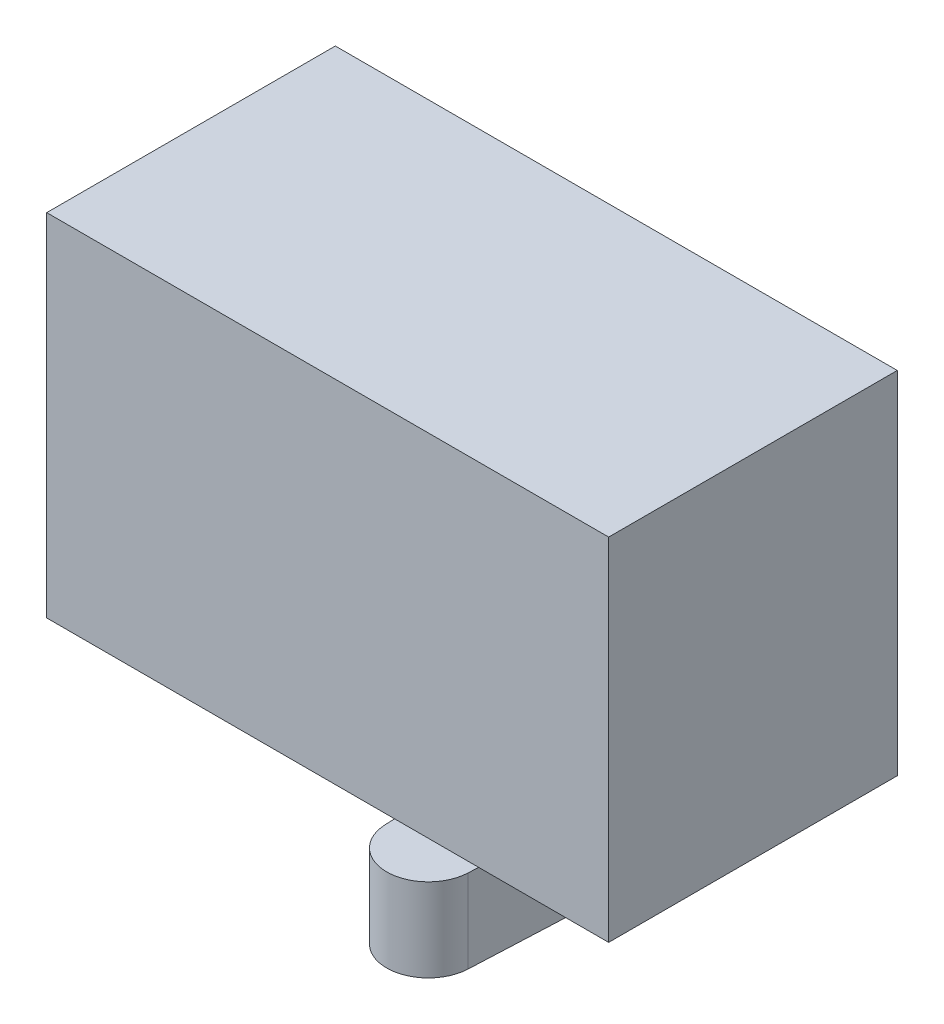
ISO-10303-21;
HEADER;
FILE_DESCRIPTION(('STEP AP214'),'2;1');
FILE_NAME('part.step','',(''),(''),'','','');
FILE_SCHEMA(('AUTOMOTIVE_DESIGN { 1 0 10303 214 1 1 1 1 }'));
ENDSEC;
DATA;
#1=APPLICATION_CONTEXT('core data for automotive mechanical design processes');
#2=APPLICATION_PROTOCOL_DEFINITION('international standard','automotive_design',2000,#1);
#3=PRODUCT_CONTEXT('',#1,'mechanical');
#4=PRODUCT('Part','Part','',(#3));
#5=PRODUCT_RELATED_PRODUCT_CATEGORY('part','',(#4));
#6=PRODUCT_DEFINITION_FORMATION('','',#4);
#7=PRODUCT_DEFINITION_CONTEXT('part definition',#1,'design');
#8=PRODUCT_DEFINITION('design','',#6,#7);
#9=PRODUCT_DEFINITION_SHAPE('','',#8);
#10=(LENGTH_UNIT() NAMED_UNIT(*) SI_UNIT(.MILLI.,.METRE.));
#11=(NAMED_UNIT(*) PLANE_ANGLE_UNIT() SI_UNIT($,.RADIAN.));
#12=(NAMED_UNIT(*) SI_UNIT($,.STERADIAN.) SOLID_ANGLE_UNIT());
#13=UNCERTAINTY_MEASURE_WITH_UNIT(LENGTH_MEASURE(1.E-05),#10,'distance_accuracy_value','');
#14=(GEOMETRIC_REPRESENTATION_CONTEXT(3) GLOBAL_UNCERTAINTY_ASSIGNED_CONTEXT((#13)) GLOBAL_UNIT_ASSIGNED_CONTEXT((#10,
#11,#12)) REPRESENTATION_CONTEXT('',''));
#15=CARTESIAN_POINT('',(0.,0.,0.));
#16=DIRECTION('',(0.,0.,1.));
#17=DIRECTION('',(1.,0.,0.));
#18=AXIS2_PLACEMENT_3D('',#15,#16,#17);
#19=CARTESIAN_POINT('',(7.85,-18.65,11.));
#20=DIRECTION('',(0.,1.,0.));
#21=DIRECTION('',(0.,0.,1.));
#22=AXIS2_PLACEMENT_3D('',#19,#20,#21);
#23=CYLINDRICAL_SURFACE('',#22,3.);
#24=CARTESIAN_POINT('',(7.85,-12.65,11.));
#25=DIRECTION('',(0.,-1.,0.));
#26=DIRECTION('',(0.,0.,-1.));
#27=AXIS2_PLACEMENT_3D('',#24,#25,#26);
#28=CIRCLE('',#27,3.);
#29=CARTESIAN_POINT('',(10.8468992239776,-12.65,11.1363636363636));
#30=VERTEX_POINT('',#29);
#31=CARTESIAN_POINT('',(4.85310077602238,-12.65,11.1363636363636));
#32=VERTEX_POINT('',#31);
#33=EDGE_CURVE('E141',#30,#32,#28,.T.);
#34=ORIENTED_EDGE('',*,*,#33,.T.);
#35=DIRECTION('',(0.,1.,0.));
#36=VECTOR('',#35,1.);
#37=CARTESIAN_POINT('',(4.85310077602238,-18.65,11.1363636363636));
#38=LINE('',#37,#36);
#39=CARTESIAN_POINT('',(4.85310077602238,-18.65,11.1363636363636));
#40=VERTEX_POINT('',#39);
#41=EDGE_CURVE('E12',#40,#32,#38,.T.);
#42=ORIENTED_EDGE('',*,*,#41,.F.);
#43=CARTESIAN_POINT('',(7.85,-18.65,11.));
#44=DIRECTION('',(0.,-1.,0.));
#45=DIRECTION('',(0.,0.,-1.));
#46=AXIS2_PLACEMENT_3D('',#43,#44,#45);
#47=CIRCLE('',#46,3.);
#48=CARTESIAN_POINT('',(10.8468992239776,-18.65,11.1363636363636));
#49=VERTEX_POINT('',#48);
#50=EDGE_CURVE('E155',#49,#40,#47,.T.);
#51=ORIENTED_EDGE('',*,*,#50,.F.);
#52=DIRECTION('',(0.,1.,0.));
#53=VECTOR('',#52,1.);
#54=CARTESIAN_POINT('',(10.8468992239776,-18.65,11.1363636363636));
#55=LINE('',#54,#53);
#56=EDGE_CURVE('E137',#49,#30,#55,.T.);
#57=ORIENTED_EDGE('',*,*,#56,.T.);
#58=EDGE_LOOP('',(#34,#42,#51,#57));
#59=FACE_BOUND('',#58,.T.);
#60=ADVANCED_FACE('F45',(#59),#23,.T.);
#61=CARTESIAN_POINT('',(4.85310077602238,-18.65,11.1363636363636));
#62=DIRECTION('',(0.998966407992541,0.,-0.0454545454545457));
#63=DIRECTION('',(-0.0454545454545457,0.,-0.998966407992542));
#64=AXIS2_PLACEMENT_3D('',#61,#62,#63);
#65=PLANE('',#64);
#66=DIRECTION('',(-0.0454545454545457,0.,-0.998966407992541));
#67=VECTOR('',#66,1.);
#68=CARTESIAN_POINT('',(4.85310077602238,-12.65,11.1363636363636));
#69=LINE('',#68,#67);
#70=CARTESIAN_POINT('',(4.3536175720261,-12.65,0.159090909090907));
#71=VERTEX_POINT('',#70);
#72=EDGE_CURVE('E144',#32,#71,#69,.T.);
#73=ORIENTED_EDGE('',*,*,#72,.T.);
#74=DIRECTION('',(0.,1.,0.));
#75=VECTOR('',#74,1.);
#76=CARTESIAN_POINT('',(4.3536175720261,-18.65,0.159090909090907));
#77=LINE('',#76,#75);
#78=CARTESIAN_POINT('',(4.3536175720261,-18.65,0.159090909090907));
#79=VERTEX_POINT('',#78);
#80=EDGE_CURVE('E53',#79,#71,#77,.T.);
#81=ORIENTED_EDGE('',*,*,#80,.F.);
#82=DIRECTION('',(-0.0454545454545457,0.,-0.998966407992541));
#83=VECTOR('',#82,1.);
#84=CARTESIAN_POINT('',(4.85310077602238,-18.65,11.1363636363636));
#85=LINE('',#84,#83);
#86=EDGE_CURVE('E104',#40,#79,#85,.T.);
#87=ORIENTED_EDGE('',*,*,#86,.F.);
#88=ORIENTED_EDGE('',*,*,#41,.T.);
#89=EDGE_LOOP('',(#73,#81,#87,#88));
#90=FACE_BOUND('',#89,.T.);
#91=ADVANCED_FACE('F190',(#90),#65,.F.);
#92=CARTESIAN_POINT('',(7.85,-18.65,0.));
#93=DIRECTION('',(0.,1.,0.));
#94=DIRECTION('',(0.,0.,1.));
#95=AXIS2_PLACEMENT_3D('',#92,#93,#94);
#96=CYLINDRICAL_SURFACE('',#95,3.5);
#97=CARTESIAN_POINT('',(7.85,-12.65,0.));
#98=DIRECTION('',(0.,-1.,0.));
#99=DIRECTION('',(0.,0.,-1.));
#100=AXIS2_PLACEMENT_3D('',#97,#98,#99);
#101=CIRCLE('',#100,3.5);
#102=CARTESIAN_POINT('',(4.3536175720261,-12.65,-0.159090909090905));
#103=VERTEX_POINT('',#102);
#104=EDGE_CURVE('E146',#71,#103,#101,.T.);
#105=ORIENTED_EDGE('',*,*,#104,.T.);
#106=DIRECTION('',(0.,1.,0.));
#107=VECTOR('',#106,1.);
#108=CARTESIAN_POINT('',(4.3536175720261,-18.65,-0.159090909090905));
#109=LINE('',#108,#107);
#110=CARTESIAN_POINT('',(4.3536175720261,-18.65,-0.159090909090905));
#111=VERTEX_POINT('',#110);
#112=EDGE_CURVE('E162',#111,#103,#109,.T.);
#113=ORIENTED_EDGE('',*,*,#112,.F.);
#114=CARTESIAN_POINT('',(7.85,-18.65,0.));
#115=DIRECTION('',(0.,-1.,0.));
#116=DIRECTION('',(0.,0.,-1.));
#117=AXIS2_PLACEMENT_3D('',#114,#115,#116);
#118=CIRCLE('',#117,3.5);
#119=EDGE_CURVE('E170',#79,#111,#118,.T.);
#120=ORIENTED_EDGE('',*,*,#119,.F.);
#121=ORIENTED_EDGE('',*,*,#80,.T.);
#122=EDGE_LOOP('',(#105,#113,#120,#121));
#123=FACE_BOUND('',#122,.T.);
#124=ADVANCED_FACE('F168',(#123),#96,.T.);
#125=CARTESIAN_POINT('',(4.3536175720261,-18.65,-0.159090909090907));
#126=DIRECTION('',(0.998966407992541,0.,0.0454545454545457));
#127=DIRECTION('',(0.0454545454545457,0.,-0.998966407992542));
#128=AXIS2_PLACEMENT_3D('',#125,#126,#127);
#129=PLANE('',#128);
#130=DIRECTION('',(0.0454545454545457,0.,-0.998966407992541));
#131=VECTOR('',#130,1.);
#132=CARTESIAN_POINT('',(4.3536175720261,-12.65,-0.159090909090907));
#133=LINE('',#132,#131);
#134=CARTESIAN_POINT('',(4.85310077602238,-12.65,-11.1363636363636));
#135=VERTEX_POINT('',#134);
#136=EDGE_CURVE('E148',#103,#135,#133,.T.);
#137=ORIENTED_EDGE('',*,*,#136,.T.);
#138=DIRECTION('',(0.,1.,0.));
#139=VECTOR('',#138,1.);
#140=CARTESIAN_POINT('',(4.85310077602238,-18.65,-11.1363636363636));
#141=LINE('',#140,#139);
#142=CARTESIAN_POINT('',(4.85310077602238,-18.65,-11.1363636363636));
#143=VERTEX_POINT('',#142);
#144=EDGE_CURVE('E159',#143,#135,#141,.T.);
#145=ORIENTED_EDGE('',*,*,#144,.F.);
#146=DIRECTION('',(0.0454545454545457,0.,-0.998966407992541));
#147=VECTOR('',#146,1.);
#148=CARTESIAN_POINT('',(4.3536175720261,-18.65,-0.159090909090907));
#149=LINE('',#148,#147);
#150=EDGE_CURVE('E182',#111,#143,#149,.T.);
#151=ORIENTED_EDGE('',*,*,#150,.F.);
#152=ORIENTED_EDGE('',*,*,#112,.T.);
#153=EDGE_LOOP('',(#137,#145,#151,#152));
#154=FACE_BOUND('',#153,.T.);
#155=ADVANCED_FACE('F178',(#154),#129,.F.);
#156=CARTESIAN_POINT('',(7.85,-18.65,-11.));
#157=DIRECTION('',(0.,1.,0.));
#158=DIRECTION('',(0.,0.,1.));
#159=AXIS2_PLACEMENT_3D('',#156,#157,#158);
#160=CYLINDRICAL_SURFACE('',#159,3.);
#161=CARTESIAN_POINT('',(7.85,-12.65,-11.));
#162=DIRECTION('',(0.,-1.,0.));
#163=DIRECTION('',(0.,0.,-1.));
#164=AXIS2_PLACEMENT_3D('',#161,#162,#163);
#165=CIRCLE('',#164,3.);
#166=CARTESIAN_POINT('',(10.8468992239776,-12.65,-11.1363636363636));
#167=VERTEX_POINT('',#166);
#168=EDGE_CURVE('E150',#135,#167,#165,.T.);
#169=ORIENTED_EDGE('',*,*,#168,.T.);
#170=DIRECTION('',(0.,1.,0.));
#171=VECTOR('',#170,1.);
#172=CARTESIAN_POINT('',(10.8468992239776,-18.65,-11.1363636363636));
#173=LINE('',#172,#171);
#174=CARTESIAN_POINT('',(10.8468992239776,-18.65,-11.1363636363636));
#175=VERTEX_POINT('',#174);
#176=EDGE_CURVE('E132',#175,#167,#173,.T.);
#177=ORIENTED_EDGE('',*,*,#176,.F.);
#178=CARTESIAN_POINT('',(7.85,-18.65,-11.));
#179=DIRECTION('',(0.,-1.,0.));
#180=DIRECTION('',(0.,0.,-1.));
#181=AXIS2_PLACEMENT_3D('',#178,#179,#180);
#182=CIRCLE('',#181,3.);
#183=EDGE_CURVE('E123',#143,#175,#182,.T.);
#184=ORIENTED_EDGE('',*,*,#183,.F.);
#185=ORIENTED_EDGE('',*,*,#144,.T.);
#186=EDGE_LOOP('',(#169,#177,#184,#185));
#187=FACE_BOUND('',#186,.T.);
#188=ADVANCED_FACE('F181',(#187),#160,.T.);
#189=CARTESIAN_POINT('',(10.8468992239776,-18.65,-11.1363636363636));
#190=DIRECTION('',(-0.998966407992541,0.,0.0454545454545457));
#191=DIRECTION('',(0.0454545454545457,0.,0.998966407992542));
#192=AXIS2_PLACEMENT_3D('',#189,#190,#191);
#193=PLANE('',#192);
#194=DIRECTION('',(0.0454545454545457,0.,0.998966407992541));
#195=VECTOR('',#194,1.);
#196=CARTESIAN_POINT('',(10.8468992239776,-12.65,-11.1363636363636));
#197=LINE('',#196,#195);
#198=CARTESIAN_POINT('',(11.3463824279739,-12.65,-0.159090909090907));
#199=VERTEX_POINT('',#198);
#200=EDGE_CURVE('E131',#167,#199,#197,.T.);
#201=ORIENTED_EDGE('',*,*,#200,.T.);
#202=DIRECTION('',(0.,1.,0.));
#203=VECTOR('',#202,1.);
#204=CARTESIAN_POINT('',(11.3463824279739,-18.65,-0.159090909090907));
#205=LINE('',#204,#203);
#206=CARTESIAN_POINT('',(11.3463824279739,-18.65,-0.159090909090907));
#207=VERTEX_POINT('',#206);
#208=EDGE_CURVE('E128',#207,#199,#205,.T.);
#209=ORIENTED_EDGE('',*,*,#208,.F.);
#210=DIRECTION('',(0.0454545454545457,0.,0.998966407992541));
#211=VECTOR('',#210,1.);
#212=CARTESIAN_POINT('',(10.8468992239776,-18.65,-11.1363636363636));
#213=LINE('',#212,#211);
#214=EDGE_CURVE('E117',#175,#207,#213,.T.);
#215=ORIENTED_EDGE('',*,*,#214,.F.);
#216=ORIENTED_EDGE('',*,*,#176,.T.);
#217=EDGE_LOOP('',(#201,#209,#215,#216));
#218=FACE_BOUND('',#217,.T.);
#219=ADVANCED_FACE('F129',(#218),#193,.F.);
#220=CARTESIAN_POINT('',(7.85,-18.65,0.));
#221=DIRECTION('',(0.,1.,0.));
#222=DIRECTION('',(0.,0.,1.));
#223=AXIS2_PLACEMENT_3D('',#220,#221,#222);
#224=CYLINDRICAL_SURFACE('',#223,3.5);
#225=CARTESIAN_POINT('',(7.85,-12.65,0.));
#226=DIRECTION('',(0.,-1.,0.));
#227=DIRECTION('',(0.,0.,-1.));
#228=AXIS2_PLACEMENT_3D('',#225,#226,#227);
#229=CIRCLE('',#228,3.5);
#230=CARTESIAN_POINT('',(11.3463824279739,-12.65,0.159090909090908));
#231=VERTEX_POINT('',#230);
#232=EDGE_CURVE('E90',#199,#231,#229,.T.);
#233=ORIENTED_EDGE('',*,*,#232,.T.);
#234=DIRECTION('',(0.,1.,0.));
#235=VECTOR('',#234,1.);
#236=CARTESIAN_POINT('',(11.3463824279739,-18.65,0.159090909090908));
#237=LINE('',#236,#235);
#238=CARTESIAN_POINT('',(11.3463824279739,-18.65,0.159090909090908));
#239=VERTEX_POINT('',#238);
#240=EDGE_CURVE('E133',#239,#231,#237,.T.);
#241=ORIENTED_EDGE('',*,*,#240,.F.);
#242=CARTESIAN_POINT('',(7.85,-18.65,0.));
#243=DIRECTION('',(0.,-1.,0.));
#244=DIRECTION('',(0.,0.,-1.));
#245=AXIS2_PLACEMENT_3D('',#242,#243,#244);
#246=CIRCLE('',#245,3.5);
#247=EDGE_CURVE('E121',#207,#239,#246,.T.);
#248=ORIENTED_EDGE('',*,*,#247,.F.);
#249=ORIENTED_EDGE('',*,*,#208,.T.);
#250=EDGE_LOOP('',(#233,#241,#248,#249));
#251=FACE_BOUND('',#250,.T.);
#252=ADVANCED_FACE('F135',(#251),#224,.T.);
#253=CARTESIAN_POINT('',(11.3463824279739,-18.65,0.159090909090907));
#254=DIRECTION('',(-0.998966407992541,0.,-0.0454545454545457));
#255=DIRECTION('',(-0.0454545454545457,0.,0.998966407992542));
#256=AXIS2_PLACEMENT_3D('',#253,#254,#255);
#257=PLANE('',#256);
#258=DIRECTION('',(-0.0454545454545457,0.,0.998966407992541));
#259=VECTOR('',#258,1.);
#260=CARTESIAN_POINT('',(11.3463824279739,-12.65,0.159090909090907));
#261=LINE('',#260,#259);
#262=EDGE_CURVE('E96',#231,#30,#261,.T.);
#263=ORIENTED_EDGE('',*,*,#262,.T.);
#264=ORIENTED_EDGE('',*,*,#56,.F.);
#265=DIRECTION('',(-0.0454545454545457,0.,0.998966407992541));
#266=VECTOR('',#265,1.);
#267=CARTESIAN_POINT('',(11.3463824279739,-18.65,0.159090909090907));
#268=LINE('',#267,#266);
#269=EDGE_CURVE('E61',#239,#49,#268,.T.);
#270=ORIENTED_EDGE('',*,*,#269,.F.);
#271=ORIENTED_EDGE('',*,*,#240,.T.);
#272=EDGE_LOOP('',(#263,#264,#270,#271));
#273=FACE_BOUND('',#272,.T.);
#274=ADVANCED_FACE('F206',(#273),#257,.F.);
#275=CARTESIAN_POINT('',(7.85,-18.65,11.));
#276=DIRECTION('',(0.,-1.,0.));
#277=DIRECTION('',(0.,0.,-1.));
#278=AXIS2_PLACEMENT_3D('',#275,#276,#277);
#279=PLANE('',#278);
#280=ORIENTED_EDGE('',*,*,#50,.T.);
#281=ORIENTED_EDGE('',*,*,#86,.T.);
#282=ORIENTED_EDGE('',*,*,#119,.T.);
#283=ORIENTED_EDGE('',*,*,#150,.T.);
#284=ORIENTED_EDGE('',*,*,#183,.T.);
#285=ORIENTED_EDGE('',*,*,#214,.T.);
#286=ORIENTED_EDGE('',*,*,#247,.T.);
#287=ORIENTED_EDGE('',*,*,#269,.T.);
#288=EDGE_LOOP('',(#280,#281,#282,#283,#284,#285,#286,#287));
#289=FACE_BOUND('',#288,.T.);
#290=ADVANCED_FACE('F119',(#289),#279,.T.);
#291=CARTESIAN_POINT('',(7.85,-12.65,11.));
#292=DIRECTION('',(0.,-1.,0.));
#293=DIRECTION('',(0.,0.,-1.));
#294=AXIS2_PLACEMENT_3D('',#291,#292,#293);
#295=PLANE('',#294);
#296=ORIENTED_EDGE('',*,*,#33,.F.);
#297=ORIENTED_EDGE('',*,*,#262,.F.);
#298=ORIENTED_EDGE('',*,*,#232,.F.);
#299=ORIENTED_EDGE('',*,*,#200,.F.);
#300=ORIENTED_EDGE('',*,*,#168,.F.);
#301=ORIENTED_EDGE('',*,*,#136,.F.);
#302=ORIENTED_EDGE('',*,*,#104,.F.);
#303=ORIENTED_EDGE('',*,*,#72,.F.);
#304=EDGE_LOOP('',(#296,#297,#298,#299,#300,#301,#302,#303));
#305=FACE_BOUND('',#304,.T.);
#306=ADVANCED_FACE('F174',(#305),#295,.F.);
#307=CLOSED_SHELL('',(#60,#91,#124,#155,#188,#219,#252,#274,#290,#306));
#308=MANIFOLD_SOLID_BREP('B2',#307);
#309=CARTESIAN_POINT('',(20.25,-12.65,10.4));
#310=DIRECTION('',(-1.,0.,0.));
#311=DIRECTION('',(0.,0.,1.));
#312=AXIS2_PLACEMENT_3D('',#309,#310,#311);
#313=PLANE('',#312);
#314=DIRECTION('',(0.,1.,0.));
#315=VECTOR('',#314,1.);
#316=CARTESIAN_POINT('',(20.25,-12.65,-10.4));
#317=LINE('',#316,#315);
#318=CARTESIAN_POINT('',(20.25,-12.65,-10.4));
#319=VERTEX_POINT('',#318);
#320=CARTESIAN_POINT('',(20.25,12.65,-10.4));
#321=VERTEX_POINT('',#320);
#322=EDGE_CURVE('E336',#319,#321,#317,.T.);
#323=ORIENTED_EDGE('',*,*,#322,.T.);
#324=DIRECTION('',(0.,0.,-1.));
#325=VECTOR('',#324,1.);
#326=CARTESIAN_POINT('',(20.25,12.65,10.4));
#327=LINE('',#326,#325);
#328=CARTESIAN_POINT('',(20.25,12.65,10.4));
#329=VERTEX_POINT('',#328);
#330=EDGE_CURVE('E43',#329,#321,#327,.T.);
#331=ORIENTED_EDGE('',*,*,#330,.F.);
#332=DIRECTION('',(0.,1.,0.));
#333=VECTOR('',#332,1.);
#334=CARTESIAN_POINT('',(20.25,-12.65,10.4));
#335=LINE('',#334,#333);
#336=CARTESIAN_POINT('',(20.25,-12.65,10.4));
#337=VERTEX_POINT('',#336);
#338=EDGE_CURVE('E324',#337,#329,#335,.T.);
#339=ORIENTED_EDGE('',*,*,#338,.F.);
#340=DIRECTION('',(0.,0.,-1.));
#341=VECTOR('',#340,1.);
#342=CARTESIAN_POINT('',(20.25,-12.65,10.4));
#343=LINE('',#342,#341);
#344=EDGE_CURVE('E332',#337,#319,#343,.T.);
#345=ORIENTED_EDGE('',*,*,#344,.T.);
#346=EDGE_LOOP('',(#323,#331,#339,#345));
#347=FACE_BOUND('',#346,.T.);
#348=ADVANCED_FACE('F273',(#347),#313,.F.);
#349=CARTESIAN_POINT('',(-20.25,12.65,10.4));
#350=DIRECTION('',(0.,-1.,0.));
#351=DIRECTION('',(0.,0.,-1.));
#352=AXIS2_PLACEMENT_3D('',#349,#350,#351);
#353=PLANE('',#352);
#354=DIRECTION('',(-1.,0.,0.));
#355=VECTOR('',#354,1.);
#356=CARTESIAN_POINT('',(-20.25,12.65,-10.4));
#357=LINE('',#356,#355);
#358=CARTESIAN_POINT('',(-20.25,12.65,-10.4));
#359=VERTEX_POINT('',#358);
#360=EDGE_CURVE('E328',#321,#359,#357,.T.);
#361=ORIENTED_EDGE('',*,*,#360,.T.);
#362=DIRECTION('',(0.,0.,-1.));
#363=VECTOR('',#362,1.);
#364=CARTESIAN_POINT('',(-20.25,12.65,10.4));
#365=LINE('',#364,#363);
#366=CARTESIAN_POINT('',(-20.25,12.65,10.4));
#367=VERTEX_POINT('',#366);
#368=EDGE_CURVE('E281',#367,#359,#365,.T.);
#369=ORIENTED_EDGE('',*,*,#368,.F.);
#370=DIRECTION('',(-1.,0.,0.));
#371=VECTOR('',#370,1.);
#372=CARTESIAN_POINT('',(-20.25,12.65,10.4));
#373=LINE('',#372,#371);
#374=EDGE_CURVE('E319',#329,#367,#373,.T.);
#375=ORIENTED_EDGE('',*,*,#374,.F.);
#376=ORIENTED_EDGE('',*,*,#330,.T.);
#377=EDGE_LOOP('',(#361,#369,#375,#376));
#378=FACE_BOUND('',#377,.T.);
#379=ADVANCED_FACE('F327',(#378),#353,.F.);
#380=CARTESIAN_POINT('',(-20.25,-12.65,10.4));
#381=DIRECTION('',(1.,0.,0.));
#382=DIRECTION('',(0.,0.,-1.));
#383=AXIS2_PLACEMENT_3D('',#380,#381,#382);
#384=PLANE('',#383);
#385=DIRECTION('',(0.,-1.,0.));
#386=VECTOR('',#385,1.);
#387=CARTESIAN_POINT('',(-20.25,-12.65,-10.4));
#388=LINE('',#387,#386);
#389=CARTESIAN_POINT('',(-20.25,-12.65,-10.4));
#390=VERTEX_POINT('',#389);
#391=EDGE_CURVE('E306',#359,#390,#388,.T.);
#392=ORIENTED_EDGE('',*,*,#391,.T.);
#393=DIRECTION('',(0.,0.,-1.));
#394=VECTOR('',#393,1.);
#395=CARTESIAN_POINT('',(-20.25,-12.65,10.4));
#396=LINE('',#395,#394);
#397=CARTESIAN_POINT('',(-20.25,-12.65,10.4));
#398=VERTEX_POINT('',#397);
#399=EDGE_CURVE('E329',#398,#390,#396,.T.);
#400=ORIENTED_EDGE('',*,*,#399,.F.);
#401=DIRECTION('',(0.,-1.,0.));
#402=VECTOR('',#401,1.);
#403=CARTESIAN_POINT('',(-20.25,-12.65,10.4));
#404=LINE('',#403,#402);
#405=EDGE_CURVE('E322',#367,#398,#404,.T.);
#406=ORIENTED_EDGE('',*,*,#405,.F.);
#407=ORIENTED_EDGE('',*,*,#368,.T.);
#408=EDGE_LOOP('',(#392,#400,#406,#407));
#409=FACE_BOUND('',#408,.T.);
#410=ADVANCED_FACE('F330',(#409),#384,.F.);
#411=CARTESIAN_POINT('',(-20.25,-12.65,10.4));
#412=DIRECTION('',(0.,1.,0.));
#413=DIRECTION('',(0.,0.,1.));
#414=AXIS2_PLACEMENT_3D('',#411,#412,#413);
#415=PLANE('',#414);
#416=DIRECTION('',(1.,0.,0.));
#417=VECTOR('',#416,1.);
#418=CARTESIAN_POINT('',(-20.25,-12.65,-10.4));
#419=LINE('',#418,#417);
#420=EDGE_CURVE('E312',#390,#319,#419,.T.);
#421=ORIENTED_EDGE('',*,*,#420,.T.);
#422=ORIENTED_EDGE('',*,*,#344,.F.);
#423=DIRECTION('',(1.,0.,0.));
#424=VECTOR('',#423,1.);
#425=CARTESIAN_POINT('',(-20.25,-12.65,10.4));
#426=LINE('',#425,#424);
#427=EDGE_CURVE('E289',#398,#337,#426,.T.);
#428=ORIENTED_EDGE('',*,*,#427,.F.);
#429=ORIENTED_EDGE('',*,*,#399,.T.);
#430=EDGE_LOOP('',(#421,#422,#428,#429));
#431=FACE_BOUND('',#430,.T.);
#432=ADVANCED_FACE('F343',(#431),#415,.F.);
#433=CARTESIAN_POINT('',(0.,0.,10.4));
#434=DIRECTION('',(0.,0.,-1.));
#435=DIRECTION('',(-1.,0.,0.));
#436=AXIS2_PLACEMENT_3D('',#433,#434,#435);
#437=PLANE('',#436);
#438=ORIENTED_EDGE('',*,*,#338,.T.);
#439=ORIENTED_EDGE('',*,*,#374,.T.);
#440=ORIENTED_EDGE('',*,*,#405,.T.);
#441=ORIENTED_EDGE('',*,*,#427,.T.);
#442=EDGE_LOOP('',(#438,#439,#440,#441));
#443=FACE_BOUND('',#442,.T.);
#444=ADVANCED_FACE('F320',(#443),#437,.F.);
#445=CARTESIAN_POINT('',(0.,0.,-10.4));
#446=DIRECTION('',(0.,0.,-1.));
#447=DIRECTION('',(-1.,0.,0.));
#448=AXIS2_PLACEMENT_3D('',#445,#446,#447);
#449=PLANE('',#448);
#450=ORIENTED_EDGE('',*,*,#322,.F.);
#451=ORIENTED_EDGE('',*,*,#420,.F.);
#452=ORIENTED_EDGE('',*,*,#391,.F.);
#453=ORIENTED_EDGE('',*,*,#360,.F.);
#454=EDGE_LOOP('',(#450,#451,#452,#453));
#455=FACE_BOUND('',#454,.T.);
#456=ADVANCED_FACE('F346',(#455),#449,.T.);
#457=CLOSED_SHELL('',(#348,#379,#410,#432,#444,#456));
#458=MANIFOLD_SOLID_BREP('B6',#457);
#459=ADVANCED_BREP_SHAPE_REPRESENTATION('',(#18,#308,#458),#14);
#460=SHAPE_DEFINITION_REPRESENTATION(#9,#459);
ENDSEC;
END-ISO-10303-21;
